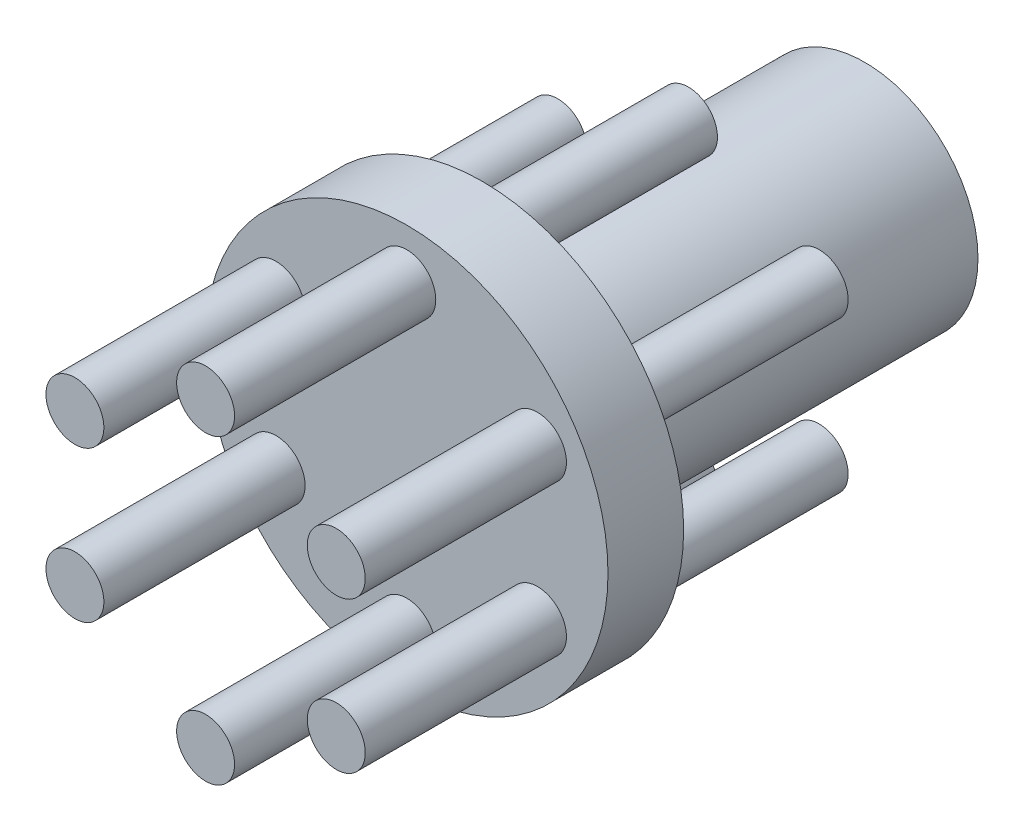
ISO-10303-21;
HEADER;
FILE_DESCRIPTION(('STEP AP214'),'2;1');
FILE_NAME('part.step','',(''),(''),'','','');
FILE_SCHEMA(('AUTOMOTIVE_DESIGN { 1 0 10303 214 1 1 1 1 }'));
ENDSEC;
DATA;
#1=APPLICATION_CONTEXT('core data for automotive mechanical design processes');
#2=APPLICATION_PROTOCOL_DEFINITION('international standard','automotive_design',2000,#1);
#3=PRODUCT_CONTEXT('',#1,'mechanical');
#4=PRODUCT('Part','Part','',(#3));
#5=PRODUCT_RELATED_PRODUCT_CATEGORY('part','',(#4));
#6=PRODUCT_DEFINITION_FORMATION('','',#4);
#7=PRODUCT_DEFINITION_CONTEXT('part definition',#1,'design');
#8=PRODUCT_DEFINITION('design','',#6,#7);
#9=PRODUCT_DEFINITION_SHAPE('','',#8);
#10=(LENGTH_UNIT() NAMED_UNIT(*) SI_UNIT(.MILLI.,.METRE.));
#11=(NAMED_UNIT(*) PLANE_ANGLE_UNIT() SI_UNIT($,.RADIAN.));
#12=(NAMED_UNIT(*) SI_UNIT($,.STERADIAN.) SOLID_ANGLE_UNIT());
#13=UNCERTAINTY_MEASURE_WITH_UNIT(LENGTH_MEASURE(1.E-05),#10,'distance_accuracy_value','');
#14=(GEOMETRIC_REPRESENTATION_CONTEXT(3) GLOBAL_UNCERTAINTY_ASSIGNED_CONTEXT((#13)) GLOBAL_UNIT_ASSIGNED_CONTEXT((#10,
#11,#12)) REPRESENTATION_CONTEXT('',''));
#15=CARTESIAN_POINT('',(0.,0.,0.));
#16=DIRECTION('',(0.,0.,1.));
#17=DIRECTION('',(1.,0.,0.));
#18=AXIS2_PLACEMENT_3D('',#15,#16,#17);
#19=CARTESIAN_POINT('',(0.,0.,0.));
#20=DIRECTION('',(0.,0.,1.));
#21=DIRECTION('',(1.,0.,0.));
#22=AXIS2_PLACEMENT_3D('',#19,#20,#21);
#23=PLANE('',#22);
#24=CARTESIAN_POINT('',(-8.24889197104655,4.76249999999958,0.));
#25=DIRECTION('',(0.,0.,1.));
#26=DIRECTION('',(1.,0.,0.));
#27=AXIS2_PLACEMENT_3D('',#24,#25,#26);
#28=CIRCLE('',#27,1.8288);
#29=CARTESIAN_POINT('',(-6.42009197104655,4.76249999999958,0.));
#30=VERTEX_POINT('',#29);
#31=EDGE_CURVE('E114',#30,#30,#28,.T.);
#32=ORIENTED_EDGE('',*,*,#31,.T.);
#33=EDGE_LOOP('',(#32));
#34=FACE_BOUND('',#33,.T.);
#35=CARTESIAN_POINT('',(-8.24889197104607,-4.76250000000041,0.));
#36=DIRECTION('',(0.,0.,1.));
#37=DIRECTION('',(1.,0.,0.));
#38=AXIS2_PLACEMENT_3D('',#35,#36,#37);
#39=CIRCLE('',#38,1.8288);
#40=CARTESIAN_POINT('',(-6.42009197104607,-4.76250000000041,0.));
#41=VERTEX_POINT('',#40);
#42=EDGE_CURVE('E105',#41,#41,#39,.T.);
#43=ORIENTED_EDGE('',*,*,#42,.T.);
#44=EDGE_LOOP('',(#43));
#45=FACE_BOUND('',#44,.T.);
#46=CARTESIAN_POINT('',(9.44592547945624E-13,-9.525,0.));
#47=DIRECTION('',(0.,0.,1.));
#48=DIRECTION('',(1.,0.,0.));
#49=AXIS2_PLACEMENT_3D('',#46,#47,#48);
#50=CIRCLE('',#49,1.8288);
#51=CARTESIAN_POINT('',(1.82880000000094,-9.525,0.));
#52=VERTEX_POINT('',#51);
#53=EDGE_CURVE('E96',#52,#52,#50,.T.);
#54=ORIENTED_EDGE('',*,*,#53,.T.);
#55=EDGE_LOOP('',(#54));
#56=FACE_BOUND('',#55,.T.);
#57=CARTESIAN_POINT('',(8.24889197104749,-4.76249999999959,0.));
#58=DIRECTION('',(0.,0.,1.));
#59=DIRECTION('',(1.,0.,0.));
#60=AXIS2_PLACEMENT_3D('',#57,#58,#59);
#61=CIRCLE('',#60,1.8288);
#62=CARTESIAN_POINT('',(10.0776919710475,-4.76249999999959,0.));
#63=VERTEX_POINT('',#62);
#64=EDGE_CURVE('E87',#63,#63,#61,.T.);
#65=ORIENTED_EDGE('',*,*,#64,.T.);
#66=EDGE_LOOP('',(#65));
#67=FACE_BOUND('',#66,.T.);
#68=CARTESIAN_POINT('',(8.24889197104701,4.76250000000041,0.));
#69=DIRECTION('',(0.,0.,1.));
#70=DIRECTION('',(1.,0.,0.));
#71=AXIS2_PLACEMENT_3D('',#68,#69,#70);
#72=CIRCLE('',#71,1.8288);
#73=CARTESIAN_POINT('',(10.077691971047,4.76250000000041,0.));
#74=VERTEX_POINT('',#73);
#75=EDGE_CURVE('E78',#74,#74,#72,.T.);
#76=ORIENTED_EDGE('',*,*,#75,.T.);
#77=EDGE_LOOP('',(#76));
#78=FACE_BOUND('',#77,.T.);
#79=CARTESIAN_POINT('',(0.,9.525,0.));
#80=DIRECTION('',(0.,0.,1.));
#81=DIRECTION('',(1.,0.,0.));
#82=AXIS2_PLACEMENT_3D('',#79,#80,#81);
#83=CIRCLE('',#82,1.8288);
#84=CARTESIAN_POINT('',(1.8288,9.525,0.));
#85=VERTEX_POINT('',#84);
#86=EDGE_CURVE('E69',#85,#85,#83,.T.);
#87=ORIENTED_EDGE('',*,*,#86,.T.);
#88=EDGE_LOOP('',(#87));
#89=FACE_BOUND('',#88,.T.);
#90=CARTESIAN_POINT('',(0.,0.,0.));
#91=DIRECTION('',(0.,0.,1.));
#92=DIRECTION('',(1.,0.,0.));
#93=AXIS2_PLACEMENT_3D('',#90,#91,#92);
#94=CIRCLE('',#93,12.7);
#95=CARTESIAN_POINT('',(12.7,0.,0.));
#96=VERTEX_POINT('',#95);
#97=EDGE_CURVE('E61',#96,#96,#94,.T.);
#98=ORIENTED_EDGE('',*,*,#97,.F.);
#99=EDGE_LOOP('',(#98));
#100=FACE_BOUND('',#99,.T.);
#101=CARTESIAN_POINT('',(0.,0.,0.));
#102=DIRECTION('',(0.,0.,1.));
#103=DIRECTION('',(1.,0.,0.));
#104=AXIS2_PLACEMENT_3D('',#101,#102,#103);
#105=CIRCLE('',#104,7.1501);
#106=CARTESIAN_POINT('',(7.1501,0.,0.));
#107=VERTEX_POINT('',#106);
#108=EDGE_CURVE('E57',#107,#107,#105,.F.);
#109=ORIENTED_EDGE('',*,*,#108,.F.);
#110=EDGE_LOOP('',(#109));
#111=FACE_BOUND('',#110,.T.);
#112=ADVANCED_FACE('F31',(#34,#45,#56,#67,#78,#89,#100,#111),#23,.F.);
#113=CARTESIAN_POINT('',(0.,0.,4.7752));
#114=DIRECTION('',(0.,0.,-1.));
#115=DIRECTION('',(-1.,0.,0.));
#116=AXIS2_PLACEMENT_3D('',#113,#114,#115);
#117=CYLINDRICAL_SURFACE('',#116,12.7);
#118=CARTESIAN_POINT('',(0.,0.,4.7752));
#119=DIRECTION('',(0.,0.,1.));
#120=DIRECTION('',(1.,0.,0.));
#121=AXIS2_PLACEMENT_3D('',#118,#119,#120);
#122=CIRCLE('',#121,12.7);
#123=CARTESIAN_POINT('',(12.7,0.,4.7752));
#124=VERTEX_POINT('',#123);
#125=EDGE_CURVE('E60',#124,#124,#122,.T.);
#126=ORIENTED_EDGE('',*,*,#125,.F.);
#127=EDGE_LOOP('',(#126));
#128=FACE_BOUND('',#127,.T.);
#129=ORIENTED_EDGE('',*,*,#97,.T.);
#130=EDGE_LOOP('',(#129));
#131=FACE_BOUND('',#130,.T.);
#132=ADVANCED_FACE('F33',(#128,#131),#117,.T.);
#133=CARTESIAN_POINT('',(0.,0.,4.7752));
#134=DIRECTION('',(0.,0.,1.));
#135=DIRECTION('',(1.,0.,0.));
#136=AXIS2_PLACEMENT_3D('',#133,#134,#135);
#137=PLANE('',#136);
#138=CARTESIAN_POINT('',(-8.24889197104655,4.76249999999958,4.7752));
#139=DIRECTION('',(0.,0.,1.));
#140=DIRECTION('',(1.,0.,0.));
#141=AXIS2_PLACEMENT_3D('',#138,#139,#140);
#142=CIRCLE('',#141,1.8288);
#143=CARTESIAN_POINT('',(-6.42009197104655,4.76249999999958,4.7752));
#144=VERTEX_POINT('',#143);
#145=EDGE_CURVE('E10',#144,#144,#142,.T.);
#146=ORIENTED_EDGE('',*,*,#145,.F.);
#147=EDGE_LOOP('',(#146));
#148=FACE_BOUND('',#147,.T.);
#149=CARTESIAN_POINT('',(-8.24889197104607,-4.76250000000041,4.7752));
#150=DIRECTION('',(0.,0.,1.));
#151=DIRECTION('',(1.,0.,0.));
#152=AXIS2_PLACEMENT_3D('',#149,#150,#151);
#153=CIRCLE('',#152,1.8288);
#154=CARTESIAN_POINT('',(-6.42009197104607,-4.76250000000041,4.7752));
#155=VERTEX_POINT('',#154);
#156=EDGE_CURVE('E38',#155,#155,#153,.T.);
#157=ORIENTED_EDGE('',*,*,#156,.F.);
#158=EDGE_LOOP('',(#157));
#159=FACE_BOUND('',#158,.T.);
#160=CARTESIAN_POINT('',(9.44592547945624E-13,-9.525,4.7752));
#161=DIRECTION('',(0.,0.,1.));
#162=DIRECTION('',(1.,0.,0.));
#163=AXIS2_PLACEMENT_3D('',#160,#161,#162);
#164=CIRCLE('',#163,1.8288);
#165=CARTESIAN_POINT('',(1.82880000000094,-9.525,4.7752));
#166=VERTEX_POINT('',#165);
#167=EDGE_CURVE('E42',#166,#166,#164,.T.);
#168=ORIENTED_EDGE('',*,*,#167,.F.);
#169=EDGE_LOOP('',(#168));
#170=FACE_BOUND('',#169,.T.);
#171=CARTESIAN_POINT('',(8.24889197104749,-4.76249999999959,4.7752));
#172=DIRECTION('',(0.,0.,1.));
#173=DIRECTION('',(1.,0.,0.));
#174=AXIS2_PLACEMENT_3D('',#171,#172,#173);
#175=CIRCLE('',#174,1.8288);
#176=CARTESIAN_POINT('',(10.0776919710475,-4.76249999999959,4.7752));
#177=VERTEX_POINT('',#176);
#178=EDGE_CURVE('E46',#177,#177,#175,.T.);
#179=ORIENTED_EDGE('',*,*,#178,.F.);
#180=EDGE_LOOP('',(#179));
#181=FACE_BOUND('',#180,.T.);
#182=CARTESIAN_POINT('',(8.24889197104701,4.76250000000041,4.7752));
#183=DIRECTION('',(0.,0.,1.));
#184=DIRECTION('',(1.,0.,0.));
#185=AXIS2_PLACEMENT_3D('',#182,#183,#184);
#186=CIRCLE('',#185,1.8288);
#187=CARTESIAN_POINT('',(10.077691971047,4.76250000000041,4.7752));
#188=VERTEX_POINT('',#187);
#189=EDGE_CURVE('E51',#188,#188,#186,.T.);
#190=ORIENTED_EDGE('',*,*,#189,.F.);
#191=EDGE_LOOP('',(#190));
#192=FACE_BOUND('',#191,.T.);
#193=CARTESIAN_POINT('',(0.,9.525,4.7752));
#194=DIRECTION('',(0.,0.,1.));
#195=DIRECTION('',(1.,0.,0.));
#196=AXIS2_PLACEMENT_3D('',#193,#194,#195);
#197=CIRCLE('',#196,1.8288);
#198=CARTESIAN_POINT('',(1.8288,9.525,4.7752));
#199=VERTEX_POINT('',#198);
#200=EDGE_CURVE('E54',#199,#199,#197,.T.);
#201=ORIENTED_EDGE('',*,*,#200,.F.);
#202=EDGE_LOOP('',(#201));
#203=FACE_BOUND('',#202,.T.);
#204=ORIENTED_EDGE('',*,*,#125,.T.);
#205=EDGE_LOOP('',(#204));
#206=FACE_BOUND('',#205,.T.);
#207=ADVANCED_FACE('F145',(#148,#159,#170,#181,#192,#203,#206),#137,.T.);
#208=CARTESIAN_POINT('',(0.,0.,-24.13));
#209=DIRECTION('',(0.,0.,1.));
#210=DIRECTION('',(1.,0.,0.));
#211=AXIS2_PLACEMENT_3D('',#208,#209,#210);
#212=CYLINDRICAL_SURFACE('',#211,7.1501);
#213=CARTESIAN_POINT('',(0.,0.,-24.13));
#214=DIRECTION('',(0.,0.,-1.));
#215=DIRECTION('',(-1.,0.,0.));
#216=AXIS2_PLACEMENT_3D('',#213,#214,#215);
#217=CIRCLE('',#216,7.1501);
#218=CARTESIAN_POINT('',(-7.1501,0.,-24.13));
#219=VERTEX_POINT('',#218);
#220=EDGE_CURVE('E64',#219,#219,#217,.T.);
#221=ORIENTED_EDGE('',*,*,#220,.F.);
#222=EDGE_LOOP('',(#221));
#223=FACE_BOUND('',#222,.T.);
#224=ORIENTED_EDGE('',*,*,#108,.T.);
#225=EDGE_LOOP('',(#224));
#226=FACE_BOUND('',#225,.T.);
#227=ADVANCED_FACE('F151',(#223,#226),#212,.T.);
#228=CARTESIAN_POINT('',(0.,0.,-24.13));
#229=DIRECTION('',(0.,0.,-1.));
#230=DIRECTION('',(-1.,0.,0.));
#231=AXIS2_PLACEMENT_3D('',#228,#229,#230);
#232=PLANE('',#231);
#233=ORIENTED_EDGE('',*,*,#220,.T.);
#234=EDGE_LOOP('',(#233));
#235=FACE_BOUND('',#234,.T.);
#236=ADVANCED_FACE('F155',(#235),#232,.T.);
#237=CARTESIAN_POINT('',(0.,9.525,17.4752));
#238=DIRECTION('',(0.,0.,1.));
#239=DIRECTION('',(1.,0.,0.));
#240=AXIS2_PLACEMENT_3D('',#237,#238,#239);
#241=PLANE('',#240);
#242=CARTESIAN_POINT('',(0.,9.525,17.4752));
#243=DIRECTION('',(0.,0.,1.));
#244=DIRECTION('',(1.,0.,0.));
#245=AXIS2_PLACEMENT_3D('',#242,#243,#244);
#246=CIRCLE('',#245,1.8288);
#247=CARTESIAN_POINT('',(1.8288,9.525,17.4752));
#248=VERTEX_POINT('',#247);
#249=EDGE_CURVE('E75',#248,#248,#246,.T.);
#250=ORIENTED_EDGE('',*,*,#249,.T.);
#251=EDGE_LOOP('',(#250));
#252=FACE_BOUND('',#251,.T.);
#253=ADVANCED_FACE('F159',(#252),#241,.T.);
#254=CARTESIAN_POINT('',(0.,9.525,-13.0048));
#255=DIRECTION('',(0.,0.,1.));
#256=DIRECTION('',(1.,0.,0.));
#257=AXIS2_PLACEMENT_3D('',#254,#255,#256);
#258=CYLINDRICAL_SURFACE('',#257,1.8288);
#259=ORIENTED_EDGE('',*,*,#200,.T.);
#260=EDGE_LOOP('',(#259));
#261=FACE_BOUND('',#260,.T.);
#262=ORIENTED_EDGE('',*,*,#249,.F.);
#263=EDGE_LOOP('',(#262));
#264=FACE_BOUND('',#263,.T.);
#265=ADVANCED_FACE('F161',(#261,#264),#258,.T.);
#266=CARTESIAN_POINT('',(0.,9.525,-13.0048));
#267=DIRECTION('',(0.,0.,1.));
#268=DIRECTION('',(1.,0.,0.));
#269=AXIS2_PLACEMENT_3D('',#266,#267,#268);
#270=CIRCLE('',#269,1.8288);
#271=CARTESIAN_POINT('',(1.8288,9.525,-13.0048));
#272=VERTEX_POINT('',#271);
#273=EDGE_CURVE('E72',#272,#272,#270,.T.);
#274=ORIENTED_EDGE('',*,*,#273,.T.);
#275=EDGE_LOOP('',(#274));
#276=FACE_BOUND('',#275,.T.);
#277=ORIENTED_EDGE('',*,*,#86,.F.);
#278=EDGE_LOOP('',(#277));
#279=FACE_BOUND('',#278,.T.);
#280=ADVANCED_FACE('F164',(#276,#279),#258,.T.);
#281=CARTESIAN_POINT('',(0.,9.525,-13.0048));
#282=DIRECTION('',(0.,0.,1.));
#283=DIRECTION('',(1.,0.,0.));
#284=AXIS2_PLACEMENT_3D('',#281,#282,#283);
#285=PLANE('',#284);
#286=ORIENTED_EDGE('',*,*,#273,.F.);
#287=EDGE_LOOP('',(#286));
#288=FACE_BOUND('',#287,.T.);
#289=ADVANCED_FACE('F166',(#288),#285,.F.);
#290=CARTESIAN_POINT('',(8.24889197104701,4.76250000000041,17.4752));
#291=DIRECTION('',(0.,0.,1.));
#292=DIRECTION('',(1.,0.,0.));
#293=AXIS2_PLACEMENT_3D('',#290,#291,#292);
#294=PLANE('',#293);
#295=CARTESIAN_POINT('',(8.24889197104701,4.76250000000041,17.4752));
#296=DIRECTION('',(0.,0.,1.));
#297=DIRECTION('',(1.,0.,0.));
#298=AXIS2_PLACEMENT_3D('',#295,#296,#297);
#299=CIRCLE('',#298,1.8288);
#300=CARTESIAN_POINT('',(10.077691971047,4.76250000000041,17.4752));
#301=VERTEX_POINT('',#300);
#302=EDGE_CURVE('E84',#301,#301,#299,.T.);
#303=ORIENTED_EDGE('',*,*,#302,.T.);
#304=EDGE_LOOP('',(#303));
#305=FACE_BOUND('',#304,.T.);
#306=ADVANCED_FACE('F169',(#305),#294,.T.);
#307=CARTESIAN_POINT('',(8.24889197104701,4.76250000000041,-13.0048));
#308=DIRECTION('',(0.,0.,1.));
#309=DIRECTION('',(1.,0.,0.));
#310=AXIS2_PLACEMENT_3D('',#307,#308,#309);
#311=CYLINDRICAL_SURFACE('',#310,1.8288);
#312=ORIENTED_EDGE('',*,*,#189,.T.);
#313=EDGE_LOOP('',(#312));
#314=FACE_BOUND('',#313,.T.);
#315=ORIENTED_EDGE('',*,*,#302,.F.);
#316=EDGE_LOOP('',(#315));
#317=FACE_BOUND('',#316,.T.);
#318=ADVANCED_FACE('F174',(#314,#317),#311,.T.);
#319=CARTESIAN_POINT('',(8.24889197104701,4.76250000000041,-13.0048));
#320=DIRECTION('',(0.,0.,1.));
#321=DIRECTION('',(1.,0.,0.));
#322=AXIS2_PLACEMENT_3D('',#319,#320,#321);
#323=CIRCLE('',#322,1.8288);
#324=CARTESIAN_POINT('',(10.077691971047,4.76250000000041,-13.0048));
#325=VERTEX_POINT('',#324);
#326=EDGE_CURVE('E81',#325,#325,#323,.T.);
#327=ORIENTED_EDGE('',*,*,#326,.T.);
#328=EDGE_LOOP('',(#327));
#329=FACE_BOUND('',#328,.T.);
#330=ORIENTED_EDGE('',*,*,#75,.F.);
#331=EDGE_LOOP('',(#330));
#332=FACE_BOUND('',#331,.T.);
#333=ADVANCED_FACE('F177',(#329,#332),#311,.T.);
#334=CARTESIAN_POINT('',(8.24889197104701,4.76250000000041,-13.0048));
#335=DIRECTION('',(0.,0.,1.));
#336=DIRECTION('',(1.,0.,0.));
#337=AXIS2_PLACEMENT_3D('',#334,#335,#336);
#338=PLANE('',#337);
#339=ORIENTED_EDGE('',*,*,#326,.F.);
#340=EDGE_LOOP('',(#339));
#341=FACE_BOUND('',#340,.T.);
#342=ADVANCED_FACE('F179',(#341),#338,.F.);
#343=CARTESIAN_POINT('',(8.24889197104749,-4.76249999999959,17.4752));
#344=DIRECTION('',(0.,0.,1.));
#345=DIRECTION('',(1.,0.,0.));
#346=AXIS2_PLACEMENT_3D('',#343,#344,#345);
#347=PLANE('',#346);
#348=CARTESIAN_POINT('',(8.24889197104749,-4.76249999999959,17.4752));
#349=DIRECTION('',(0.,0.,1.));
#350=DIRECTION('',(1.,0.,0.));
#351=AXIS2_PLACEMENT_3D('',#348,#349,#350);
#352=CIRCLE('',#351,1.8288);
#353=CARTESIAN_POINT('',(10.0776919710475,-4.76249999999959,17.4752));
#354=VERTEX_POINT('',#353);
#355=EDGE_CURVE('E93',#354,#354,#352,.T.);
#356=ORIENTED_EDGE('',*,*,#355,.T.);
#357=EDGE_LOOP('',(#356));
#358=FACE_BOUND('',#357,.T.);
#359=ADVANCED_FACE('F182',(#358),#347,.T.);
#360=CARTESIAN_POINT('',(8.24889197104749,-4.76249999999959,-13.0048));
#361=DIRECTION('',(0.,0.,1.));
#362=DIRECTION('',(1.,0.,0.));
#363=AXIS2_PLACEMENT_3D('',#360,#361,#362);
#364=CYLINDRICAL_SURFACE('',#363,1.8288);
#365=ORIENTED_EDGE('',*,*,#178,.T.);
#366=EDGE_LOOP('',(#365));
#367=FACE_BOUND('',#366,.T.);
#368=ORIENTED_EDGE('',*,*,#355,.F.);
#369=EDGE_LOOP('',(#368));
#370=FACE_BOUND('',#369,.T.);
#371=ADVANCED_FACE('F187',(#367,#370),#364,.T.);
#372=CARTESIAN_POINT('',(8.24889197104749,-4.76249999999959,-13.0048));
#373=DIRECTION('',(0.,0.,1.));
#374=DIRECTION('',(1.,0.,0.));
#375=AXIS2_PLACEMENT_3D('',#372,#373,#374);
#376=CIRCLE('',#375,1.8288);
#377=CARTESIAN_POINT('',(10.0776919710475,-4.76249999999959,-13.0048));
#378=VERTEX_POINT('',#377);
#379=EDGE_CURVE('E90',#378,#378,#376,.T.);
#380=ORIENTED_EDGE('',*,*,#379,.T.);
#381=EDGE_LOOP('',(#380));
#382=FACE_BOUND('',#381,.T.);
#383=ORIENTED_EDGE('',*,*,#64,.F.);
#384=EDGE_LOOP('',(#383));
#385=FACE_BOUND('',#384,.T.);
#386=ADVANCED_FACE('F190',(#382,#385),#364,.T.);
#387=CARTESIAN_POINT('',(8.24889197104749,-4.76249999999959,-13.0048));
#388=DIRECTION('',(0.,0.,1.));
#389=DIRECTION('',(1.,0.,0.));
#390=AXIS2_PLACEMENT_3D('',#387,#388,#389);
#391=PLANE('',#390);
#392=ORIENTED_EDGE('',*,*,#379,.F.);
#393=EDGE_LOOP('',(#392));
#394=FACE_BOUND('',#393,.T.);
#395=ADVANCED_FACE('F192',(#394),#391,.F.);
#396=CARTESIAN_POINT('',(9.44592547945624E-13,-9.525,17.4752));
#397=DIRECTION('',(0.,0.,1.));
#398=DIRECTION('',(1.,0.,0.));
#399=AXIS2_PLACEMENT_3D('',#396,#397,#398);
#400=PLANE('',#399);
#401=CARTESIAN_POINT('',(9.44592547945624E-13,-9.525,17.4752));
#402=DIRECTION('',(0.,0.,1.));
#403=DIRECTION('',(1.,0.,0.));
#404=AXIS2_PLACEMENT_3D('',#401,#402,#403);
#405=CIRCLE('',#404,1.8288);
#406=CARTESIAN_POINT('',(1.82880000000094,-9.525,17.4752));
#407=VERTEX_POINT('',#406);
#408=EDGE_CURVE('E102',#407,#407,#405,.T.);
#409=ORIENTED_EDGE('',*,*,#408,.T.);
#410=EDGE_LOOP('',(#409));
#411=FACE_BOUND('',#410,.T.);
#412=ADVANCED_FACE('F195',(#411),#400,.T.);
#413=CARTESIAN_POINT('',(9.44592547945624E-13,-9.525,-13.0048));
#414=DIRECTION('',(0.,0.,1.));
#415=DIRECTION('',(1.,0.,0.));
#416=AXIS2_PLACEMENT_3D('',#413,#414,#415);
#417=CYLINDRICAL_SURFACE('',#416,1.8288);
#418=ORIENTED_EDGE('',*,*,#167,.T.);
#419=EDGE_LOOP('',(#418));
#420=FACE_BOUND('',#419,.T.);
#421=ORIENTED_EDGE('',*,*,#408,.F.);
#422=EDGE_LOOP('',(#421));
#423=FACE_BOUND('',#422,.T.);
#424=ADVANCED_FACE('F200',(#420,#423),#417,.T.);
#425=CARTESIAN_POINT('',(9.44592547945624E-13,-9.525,-13.0048));
#426=DIRECTION('',(0.,0.,1.));
#427=DIRECTION('',(1.,0.,0.));
#428=AXIS2_PLACEMENT_3D('',#425,#426,#427);
#429=CIRCLE('',#428,1.8288);
#430=CARTESIAN_POINT('',(1.82880000000094,-9.525,-13.0048));
#431=VERTEX_POINT('',#430);
#432=EDGE_CURVE('E99',#431,#431,#429,.T.);
#433=ORIENTED_EDGE('',*,*,#432,.T.);
#434=EDGE_LOOP('',(#433));
#435=FACE_BOUND('',#434,.T.);
#436=ORIENTED_EDGE('',*,*,#53,.F.);
#437=EDGE_LOOP('',(#436));
#438=FACE_BOUND('',#437,.T.);
#439=ADVANCED_FACE('F203',(#435,#438),#417,.T.);
#440=CARTESIAN_POINT('',(9.44592547945624E-13,-9.525,-13.0048));
#441=DIRECTION('',(0.,0.,1.));
#442=DIRECTION('',(1.,0.,0.));
#443=AXIS2_PLACEMENT_3D('',#440,#441,#442);
#444=PLANE('',#443);
#445=ORIENTED_EDGE('',*,*,#432,.F.);
#446=EDGE_LOOP('',(#445));
#447=FACE_BOUND('',#446,.T.);
#448=ADVANCED_FACE('F205',(#447),#444,.F.);
#449=CARTESIAN_POINT('',(-8.24889197104607,-4.76250000000041,17.4752));
#450=DIRECTION('',(0.,0.,1.));
#451=DIRECTION('',(1.,0.,0.));
#452=AXIS2_PLACEMENT_3D('',#449,#450,#451);
#453=PLANE('',#452);
#454=CARTESIAN_POINT('',(-8.24889197104607,-4.76250000000041,17.4752));
#455=DIRECTION('',(0.,0.,1.));
#456=DIRECTION('',(1.,0.,0.));
#457=AXIS2_PLACEMENT_3D('',#454,#455,#456);
#458=CIRCLE('',#457,1.8288);
#459=CARTESIAN_POINT('',(-6.42009197104607,-4.76250000000041,17.4752));
#460=VERTEX_POINT('',#459);
#461=EDGE_CURVE('E111',#460,#460,#458,.T.);
#462=ORIENTED_EDGE('',*,*,#461,.T.);
#463=EDGE_LOOP('',(#462));
#464=FACE_BOUND('',#463,.T.);
#465=ADVANCED_FACE('F208',(#464),#453,.T.);
#466=CARTESIAN_POINT('',(-8.24889197104607,-4.76250000000041,-13.0048));
#467=DIRECTION('',(0.,0.,1.));
#468=DIRECTION('',(1.,0.,0.));
#469=AXIS2_PLACEMENT_3D('',#466,#467,#468);
#470=CYLINDRICAL_SURFACE('',#469,1.8288);
#471=ORIENTED_EDGE('',*,*,#156,.T.);
#472=EDGE_LOOP('',(#471));
#473=FACE_BOUND('',#472,.T.);
#474=ORIENTED_EDGE('',*,*,#461,.F.);
#475=EDGE_LOOP('',(#474));
#476=FACE_BOUND('',#475,.T.);
#477=ADVANCED_FACE('F213',(#473,#476),#470,.T.);
#478=CARTESIAN_POINT('',(-8.24889197104607,-4.76250000000041,-13.0048));
#479=DIRECTION('',(0.,0.,1.));
#480=DIRECTION('',(1.,0.,0.));
#481=AXIS2_PLACEMENT_3D('',#478,#479,#480);
#482=CIRCLE('',#481,1.8288);
#483=CARTESIAN_POINT('',(-6.42009197104607,-4.76250000000041,-13.0048));
#484=VERTEX_POINT('',#483);
#485=EDGE_CURVE('E108',#484,#484,#482,.T.);
#486=ORIENTED_EDGE('',*,*,#485,.T.);
#487=EDGE_LOOP('',(#486));
#488=FACE_BOUND('',#487,.T.);
#489=ORIENTED_EDGE('',*,*,#42,.F.);
#490=EDGE_LOOP('',(#489));
#491=FACE_BOUND('',#490,.T.);
#492=ADVANCED_FACE('F216',(#488,#491),#470,.T.);
#493=CARTESIAN_POINT('',(-8.24889197104607,-4.76250000000041,-13.0048));
#494=DIRECTION('',(0.,0.,1.));
#495=DIRECTION('',(1.,0.,0.));
#496=AXIS2_PLACEMENT_3D('',#493,#494,#495);
#497=PLANE('',#496);
#498=ORIENTED_EDGE('',*,*,#485,.F.);
#499=EDGE_LOOP('',(#498));
#500=FACE_BOUND('',#499,.T.);
#501=ADVANCED_FACE('F136',(#500),#497,.F.);
#502=CARTESIAN_POINT('',(-8.24889197104655,4.76249999999958,17.4752));
#503=DIRECTION('',(0.,0.,1.));
#504=DIRECTION('',(1.,0.,0.));
#505=AXIS2_PLACEMENT_3D('',#502,#503,#504);
#506=PLANE('',#505);
#507=CARTESIAN_POINT('',(-8.24889197104655,4.76249999999958,17.4752));
#508=DIRECTION('',(0.,0.,1.));
#509=DIRECTION('',(1.,0.,0.));
#510=AXIS2_PLACEMENT_3D('',#507,#508,#509);
#511=CIRCLE('',#510,1.8288);
#512=CARTESIAN_POINT('',(-6.42009197104655,4.76249999999958,17.4752));
#513=VERTEX_POINT('',#512);
#514=EDGE_CURVE('E120',#513,#513,#511,.T.);
#515=ORIENTED_EDGE('',*,*,#514,.T.);
#516=EDGE_LOOP('',(#515));
#517=FACE_BOUND('',#516,.T.);
#518=ADVANCED_FACE('F124',(#517),#506,.T.);
#519=CARTESIAN_POINT('',(-8.24889197104655,4.76249999999958,-13.0048));
#520=DIRECTION('',(0.,0.,1.));
#521=DIRECTION('',(1.,0.,0.));
#522=AXIS2_PLACEMENT_3D('',#519,#520,#521);
#523=CYLINDRICAL_SURFACE('',#522,1.8288);
#524=ORIENTED_EDGE('',*,*,#145,.T.);
#525=EDGE_LOOP('',(#524));
#526=FACE_BOUND('',#525,.T.);
#527=ORIENTED_EDGE('',*,*,#514,.F.);
#528=EDGE_LOOP('',(#527));
#529=FACE_BOUND('',#528,.T.);
#530=ADVANCED_FACE('F126',(#526,#529),#523,.T.);
#531=CARTESIAN_POINT('',(-8.24889197104655,4.76249999999958,-13.0048));
#532=DIRECTION('',(0.,0.,1.));
#533=DIRECTION('',(1.,0.,0.));
#534=AXIS2_PLACEMENT_3D('',#531,#532,#533);
#535=CIRCLE('',#534,1.8288);
#536=CARTESIAN_POINT('',(-6.42009197104655,4.76249999999958,-13.0048));
#537=VERTEX_POINT('',#536);
#538=EDGE_CURVE('E117',#537,#537,#535,.T.);
#539=ORIENTED_EDGE('',*,*,#538,.T.);
#540=EDGE_LOOP('',(#539));
#541=FACE_BOUND('',#540,.T.);
#542=ORIENTED_EDGE('',*,*,#31,.F.);
#543=EDGE_LOOP('',(#542));
#544=FACE_BOUND('',#543,.T.);
#545=ADVANCED_FACE('F128',(#541,#544),#523,.T.);
#546=CARTESIAN_POINT('',(-8.24889197104655,4.76249999999958,-13.0048));
#547=DIRECTION('',(0.,0.,1.));
#548=DIRECTION('',(1.,0.,0.));
#549=AXIS2_PLACEMENT_3D('',#546,#547,#548);
#550=PLANE('',#549);
#551=ORIENTED_EDGE('',*,*,#538,.F.);
#552=EDGE_LOOP('',(#551));
#553=FACE_BOUND('',#552,.T.);
#554=ADVANCED_FACE('F134',(#553),#550,.F.);
#555=CLOSED_SHELL('',(#112,#132,#207,#227,#236,#253,#265,#280,#289,#306,#318,#333,#342,#359,
#371,#386,#395,#412,#424,#439,#448,#465,#477,#492,#501,#518,#530,#545,#554));
#556=MANIFOLD_SOLID_BREP('B2',#555);
#557=ADVANCED_BREP_SHAPE_REPRESENTATION('',(#18,#556),#14);
#558=SHAPE_DEFINITION_REPRESENTATION(#9,#557);
ENDSEC;
END-ISO-10303-21;
